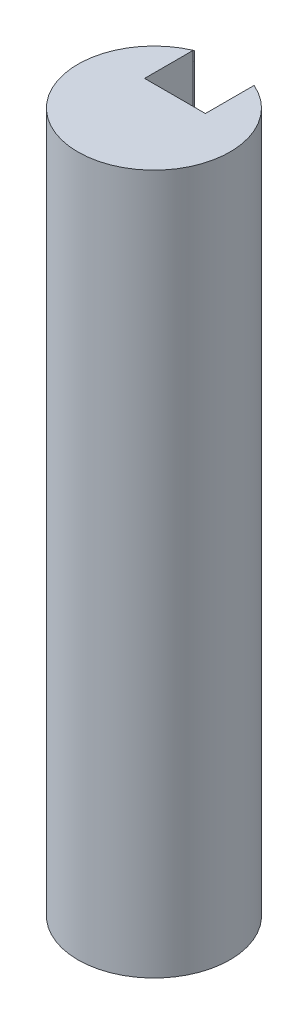
ISO-10303-21;
HEADER;
FILE_DESCRIPTION(('STEP AP214'),'2;1');
FILE_NAME('part.step','',(''),(''),'','','');
FILE_SCHEMA(('AUTOMOTIVE_DESIGN { 1 0 10303 214 1 1 1 1 }'));
ENDSEC;
DATA;
#1=APPLICATION_CONTEXT('core data for automotive mechanical design processes');
#2=APPLICATION_PROTOCOL_DEFINITION('international standard','automotive_design',2000,#1);
#3=PRODUCT_CONTEXT('',#1,'mechanical');
#4=PRODUCT('Part','Part','',(#3));
#5=PRODUCT_RELATED_PRODUCT_CATEGORY('part','',(#4));
#6=PRODUCT_DEFINITION_FORMATION('','',#4);
#7=PRODUCT_DEFINITION_CONTEXT('part definition',#1,'design');
#8=PRODUCT_DEFINITION('design','',#6,#7);
#9=PRODUCT_DEFINITION_SHAPE('','',#8);
#10=(LENGTH_UNIT() NAMED_UNIT(*) SI_UNIT(.MILLI.,.METRE.));
#11=(NAMED_UNIT(*) PLANE_ANGLE_UNIT() SI_UNIT($,.RADIAN.));
#12=(NAMED_UNIT(*) SI_UNIT($,.STERADIAN.) SOLID_ANGLE_UNIT());
#13=UNCERTAINTY_MEASURE_WITH_UNIT(LENGTH_MEASURE(1.E-05),#10,'distance_accuracy_value','');
#14=(GEOMETRIC_REPRESENTATION_CONTEXT(3) GLOBAL_UNCERTAINTY_ASSIGNED_CONTEXT((#13)) GLOBAL_UNIT_ASSIGNED_CONTEXT((#10,
#11,#12)) REPRESENTATION_CONTEXT('',''));
#15=CARTESIAN_POINT('',(0.,0.,0.));
#16=DIRECTION('',(0.,0.,1.));
#17=DIRECTION('',(1.,0.,0.));
#18=AXIS2_PLACEMENT_3D('',#15,#16,#17);
#19=CARTESIAN_POINT('',(0.,115.,0.));
#20=DIRECTION('',(0.,-1.,0.));
#21=DIRECTION('',(0.,0.,-1.));
#22=AXIS2_PLACEMENT_3D('',#19,#20,#21);
#23=CYLINDRICAL_SURFACE('',#22,12.5);
#24=CARTESIAN_POINT('',(0.,0.,0.));
#25=DIRECTION('',(0.,1.,0.));
#26=DIRECTION('',(0.,0.,1.));
#27=AXIS2_PLACEMENT_3D('',#24,#25,#26);
#28=CIRCLE('',#27,12.5);
#29=CARTESIAN_POINT('',(0.,0.,12.5));
#30=VERTEX_POINT('',#29);
#31=EDGE_CURVE('E113',#30,#30,#28,.T.);
#32=ORIENTED_EDGE('',*,*,#31,.T.);
#33=EDGE_LOOP('',(#32));
#34=FACE_BOUND('',#33,.T.);
#35=CARTESIAN_POINT('',(-4.87248671151328,70.,-11.5112498559508));
#36=DIRECTION('',(-0.918721722331272,0.,0.394905554426195));
#37=VECTOR('',#36,1.);
#38=LINE('',#35,#37);
#39=CARTESIAN_POINT('',(-4.87248671151328,70.,-11.5112498559508));
#40=VERTEX_POINT('',#39);
#41=CARTESIAN_POINT('',(-5.,70.,-11.4564392373896));
#42=VERTEX_POINT('',#41);
#43=EDGE_CURVE('E90',#40,#42,#38,.T.);
#44=ORIENTED_EDGE('',*,*,#43,.F.);
#45=CARTESIAN_POINT('',(0.,70.,0.));
#46=DIRECTION('',(0.,1.,0.));
#47=DIRECTION('',(0.,0.,1.));
#48=AXIS2_PLACEMENT_3D('',#45,#46,#47);
#49=CIRCLE('',#48,12.5);
#50=CARTESIAN_POINT('',(5.,70.,-11.4564392373896));
#51=VERTEX_POINT('',#50);
#52=EDGE_CURVE('E12',#51,#40,#49,.T.);
#53=ORIENTED_EDGE('',*,*,#52,.F.);
#54=DIRECTION('',(0.,-1.,0.));
#55=VECTOR('',#54,1.);
#56=CARTESIAN_POINT('',(5.,265.39011769395,-11.4564392373896));
#57=LINE('',#56,#55);
#58=CARTESIAN_POINT('',(5.,115.,-11.4564392373896));
#59=VERTEX_POINT('',#58);
#60=EDGE_CURVE('E172',#59,#51,#57,.T.);
#61=ORIENTED_EDGE('',*,*,#60,.F.);
#62=CARTESIAN_POINT('',(0.,115.,0.));
#63=DIRECTION('',(0.,1.,0.));
#64=DIRECTION('',(0.,0.,1.));
#65=AXIS2_PLACEMENT_3D('',#62,#63,#64);
#66=CIRCLE('',#65,12.5);
#67=CARTESIAN_POINT('',(-5.00000000000005,115.,-11.4564392373896));
#68=VERTEX_POINT('',#67);
#69=EDGE_CURVE('E53',#68,#59,#66,.T.);
#70=ORIENTED_EDGE('',*,*,#69,.F.);
#71=DIRECTION('',(0.,-1.,0.));
#72=VECTOR('',#71,1.);
#73=CARTESIAN_POINT('',(-5.,265.39011769395,-11.4564392373896));
#74=LINE('',#73,#72);
#75=EDGE_CURVE('E103',#68,#42,#74,.T.);
#76=ORIENTED_EDGE('',*,*,#75,.T.);
#77=EDGE_LOOP('',(#44,#53,#61,#70,#76));
#78=FACE_BOUND('',#77,.T.);
#79=ADVANCED_FACE('F49',(#34,#78),#23,.T.);
#80=CARTESIAN_POINT('',(0.,115.,0.));
#81=DIRECTION('',(0.,1.,0.));
#82=DIRECTION('',(0.,0.,1.));
#83=AXIS2_PLACEMENT_3D('',#80,#81,#82);
#84=PLANE('',#83);
#85=ORIENTED_EDGE('',*,*,#69,.T.);
#86=DIRECTION('',(0.,0.,-1.));
#87=VECTOR('',#86,1.);
#88=CARTESIAN_POINT('',(5.,115.,-3.4564392373896));
#89=LINE('',#88,#87);
#90=CARTESIAN_POINT('',(5.,115.,-3.4564392373896));
#91=VERTEX_POINT('',#90);
#92=EDGE_CURVE('E117',#91,#59,#89,.T.);
#93=ORIENTED_EDGE('',*,*,#92,.F.);
#94=DIRECTION('',(1.,0.,0.));
#95=VECTOR('',#94,1.);
#96=CARTESIAN_POINT('',(-5.,115.,-3.4564392373896));
#97=LINE('',#96,#95);
#98=CARTESIAN_POINT('',(-5.,115.,-3.4564392373896));
#99=VERTEX_POINT('',#98);
#100=EDGE_CURVE('E160',#99,#91,#97,.T.);
#101=ORIENTED_EDGE('',*,*,#100,.F.);
#102=DIRECTION('',(0.,0.,1.));
#103=VECTOR('',#102,1.);
#104=CARTESIAN_POINT('',(-5.,115.,-11.4564392373896));
#105=LINE('',#104,#103);
#106=EDGE_CURVE('E159',#68,#99,#105,.T.);
#107=ORIENTED_EDGE('',*,*,#106,.F.);
#108=EDGE_LOOP('',(#85,#93,#101,#107));
#109=FACE_BOUND('',#108,.T.);
#110=ADVANCED_FACE('F148',(#109),#84,.T.);
#111=CARTESIAN_POINT('',(0.,0.,0.));
#112=DIRECTION('',(0.,1.,0.));
#113=DIRECTION('',(0.,0.,1.));
#114=AXIS2_PLACEMENT_3D('',#111,#112,#113);
#115=PLANE('',#114);
#116=ORIENTED_EDGE('',*,*,#31,.F.);
#117=EDGE_LOOP('',(#116));
#118=FACE_BOUND('',#117,.T.);
#119=ADVANCED_FACE('F138',(#118),#115,.F.);
#120=CARTESIAN_POINT('',(5.,265.39011769395,-3.4564392373896));
#121=DIRECTION('',(-1.,0.,0.));
#122=DIRECTION('',(0.,0.,1.));
#123=AXIS2_PLACEMENT_3D('',#120,#121,#122);
#124=PLANE('',#123);
#125=DIRECTION('',(0.,-1.,0.));
#126=VECTOR('',#125,1.);
#127=CARTESIAN_POINT('',(5.,265.39011769395,-3.4564392373896));
#128=LINE('',#127,#126);
#129=CARTESIAN_POINT('',(5.,70.,-3.4564392373896));
#130=VERTEX_POINT('',#129);
#131=EDGE_CURVE('E162',#91,#130,#128,.T.);
#132=ORIENTED_EDGE('',*,*,#131,.F.);
#133=ORIENTED_EDGE('',*,*,#92,.T.);
#134=ORIENTED_EDGE('',*,*,#60,.T.);
#135=DIRECTION('',(0.,0.,-1.));
#136=VECTOR('',#135,1.);
#137=CARTESIAN_POINT('',(5.,70.,-3.4564392373896));
#138=LINE('',#137,#136);
#139=EDGE_CURVE('E60',#130,#51,#138,.T.);
#140=ORIENTED_EDGE('',*,*,#139,.F.);
#141=EDGE_LOOP('',(#132,#133,#134,#140));
#142=FACE_BOUND('',#141,.T.);
#143=ADVANCED_FACE('F144',(#142),#124,.T.);
#144=CARTESIAN_POINT('',(-5.,265.39011769395,-3.4564392373896));
#145=DIRECTION('',(0.,0.,-1.));
#146=DIRECTION('',(-1.,0.,0.));
#147=AXIS2_PLACEMENT_3D('',#144,#145,#146);
#148=PLANE('',#147);
#149=DIRECTION('',(0.,-1.,0.));
#150=VECTOR('',#149,1.);
#151=CARTESIAN_POINT('',(-5.,265.39011769395,-3.4564392373896));
#152=LINE('',#151,#150);
#153=CARTESIAN_POINT('',(-5.,70.,-3.4564392373896));
#154=VERTEX_POINT('',#153);
#155=EDGE_CURVE('E97',#99,#154,#152,.T.);
#156=ORIENTED_EDGE('',*,*,#155,.F.);
#157=ORIENTED_EDGE('',*,*,#100,.T.);
#158=ORIENTED_EDGE('',*,*,#131,.T.);
#159=DIRECTION('',(1.,0.,0.));
#160=VECTOR('',#159,1.);
#161=CARTESIAN_POINT('',(-5.,70.,-3.4564392373896));
#162=LINE('',#161,#160);
#163=EDGE_CURVE('E107',#154,#130,#162,.T.);
#164=ORIENTED_EDGE('',*,*,#163,.F.);
#165=EDGE_LOOP('',(#156,#157,#158,#164));
#166=FACE_BOUND('',#165,.T.);
#167=ADVANCED_FACE('F141',(#166),#148,.T.);
#168=CARTESIAN_POINT('',(-5.,265.39011769395,-11.4564392373896));
#169=DIRECTION('',(1.,0.,0.));
#170=DIRECTION('',(0.,0.,-1.));
#171=AXIS2_PLACEMENT_3D('',#168,#169,#170);
#172=PLANE('',#171);
#173=ORIENTED_EDGE('',*,*,#75,.F.);
#174=ORIENTED_EDGE('',*,*,#106,.T.);
#175=ORIENTED_EDGE('',*,*,#155,.T.);
#176=DIRECTION('',(0.,0.,1.));
#177=VECTOR('',#176,1.);
#178=CARTESIAN_POINT('',(-5.,70.,-11.4564392373896));
#179=LINE('',#178,#177);
#180=EDGE_CURVE('E88',#42,#154,#179,.T.);
#181=ORIENTED_EDGE('',*,*,#180,.F.);
#182=EDGE_LOOP('',(#173,#174,#175,#181));
#183=FACE_BOUND('',#182,.T.);
#184=ADVANCED_FACE('F102',(#183),#172,.T.);
#185=CARTESIAN_POINT('',(0.,70.,0.));
#186=DIRECTION('',(0.,1.,0.));
#187=DIRECTION('',(0.,0.,1.));
#188=AXIS2_PLACEMENT_3D('',#185,#186,#187);
#189=PLANE('',#188);
#190=ORIENTED_EDGE('',*,*,#43,.T.);
#191=ORIENTED_EDGE('',*,*,#180,.T.);
#192=ORIENTED_EDGE('',*,*,#163,.T.);
#193=ORIENTED_EDGE('',*,*,#139,.T.);
#194=ORIENTED_EDGE('',*,*,#52,.T.);
#195=EDGE_LOOP('',(#190,#191,#192,#193,#194));
#196=FACE_BOUND('',#195,.T.);
#197=ADVANCED_FACE('F92',(#196),#189,.T.);
#198=CLOSED_SHELL('',(#79,#110,#119,#143,#167,#184,#197));
#199=MANIFOLD_SOLID_BREP('B2',#198);
#200=CARTESIAN_POINT('',(0.,115.,0.));
#201=DIRECTION('',(0.,1.,0.));
#202=DIRECTION('',(0.,0.,1.));
#203=AXIS2_PLACEMENT_3D('',#200,#201,#202);
#204=PLANE('',#203);
#205=CARTESIAN_POINT('',(0.,115.,0.));
#206=DIRECTION('',(0.,1.,0.));
#207=DIRECTION('',(0.,0.,1.));
#208=AXIS2_PLACEMENT_3D('',#205,#206,#207);
#209=CIRCLE('',#208,12.5);
#210=CARTESIAN_POINT('',(-4.87248671151321,115.,-11.5112498559508));
#211=VERTEX_POINT('',#210);
#212=CARTESIAN_POINT('',(-5.,115.,-11.4564392373896));
#213=VERTEX_POINT('',#212);
#214=EDGE_CURVE('E262',#211,#213,#209,.T.);
#215=ORIENTED_EDGE('',*,*,#214,.T.);
#216=DIRECTION('',(-0.918721722331272,0.,0.394905554426196));
#217=VECTOR('',#216,1.);
#218=CARTESIAN_POINT('',(-4.87248671151336,115.,-11.5112498559507));
#219=LINE('',#218,#217);
#220=EDGE_CURVE('E252',#211,#213,#219,.T.);
#221=ORIENTED_EDGE('',*,*,#220,.F.);
#222=EDGE_LOOP('',(#215,#221));
#223=FACE_BOUND('',#222,.T.);
#224=ADVANCED_FACE('F233',(#223),#204,.T.);
#225=CARTESIAN_POINT('',(0.,115.,0.));
#226=DIRECTION('',(0.,-1.,0.));
#227=DIRECTION('',(0.,0.,-1.));
#228=AXIS2_PLACEMENT_3D('',#225,#226,#227);
#229=CYLINDRICAL_SURFACE('',#228,12.5);
#230=DIRECTION('',(0.,-1.,0.));
#231=VECTOR('',#230,1.);
#232=CARTESIAN_POINT('',(-4.87248671151336,265.39011769395,-11.5112498559507));
#233=LINE('',#232,#231);
#234=CARTESIAN_POINT('',(-4.87248671151328,70.,-11.5112498559508));
#235=VERTEX_POINT('',#234);
#236=EDGE_CURVE('E259',#211,#235,#233,.T.);
#237=ORIENTED_EDGE('',*,*,#236,.T.);
#238=CARTESIAN_POINT('',(0.,70.,0.));
#239=DIRECTION('',(0.,1.,0.));
#240=DIRECTION('',(-0.389798936921063,0.,-0.920899988476061));
#241=AXIS2_PLACEMENT_3D('',#238,#239,#240);
#242=CIRCLE('',#241,12.5);
#243=CARTESIAN_POINT('',(-5.,70.,-11.4564392373896));
#244=VERTEX_POINT('',#243);
#245=EDGE_CURVE('E242',#235,#244,#242,.T.);
#246=ORIENTED_EDGE('',*,*,#245,.T.);
#247=DIRECTION('',(0.,-1.,0.));
#248=VECTOR('',#247,1.);
#249=CARTESIAN_POINT('',(-5.00000000000023,115.,-11.4564392373895));
#250=LINE('',#249,#248);
#251=EDGE_CURVE('E47',#213,#244,#250,.T.);
#252=ORIENTED_EDGE('',*,*,#251,.F.);
#253=ORIENTED_EDGE('',*,*,#214,.F.);
#254=EDGE_LOOP('',(#237,#246,#252,#253));
#255=FACE_BOUND('',#254,.T.);
#256=ADVANCED_FACE('F235',(#255),#229,.T.);
#257=CARTESIAN_POINT('',(-4.87248671151336,265.39011769395,-11.5112498559507));
#258=DIRECTION('',(0.394905554426195,0.,0.918721722331272));
#259=DIRECTION('',(0.918721722331272,0.,-0.394905554426196));
#260=AXIS2_PLACEMENT_3D('',#257,#258,#259);
#261=PLANE('',#260);
#262=ORIENTED_EDGE('',*,*,#236,.F.);
#263=ORIENTED_EDGE('',*,*,#220,.T.);
#264=ORIENTED_EDGE('',*,*,#251,.T.);
#265=ORIENTED_EDGE('',*,*,#245,.F.);
#266=EDGE_LOOP('',(#262,#263,#264,#265));
#267=FACE_BOUND('',#266,.T.);
#268=ADVANCED_FACE('F258',(#267),#261,.T.);
#269=CLOSED_SHELL('',(#224,#256,#268));
#270=MANIFOLD_SOLID_BREP('B6',#269);
#271=ADVANCED_BREP_SHAPE_REPRESENTATION('',(#18,#199,#270),#14);
#272=SHAPE_DEFINITION_REPRESENTATION(#9,#271);
ENDSEC;
END-ISO-10303-21;
